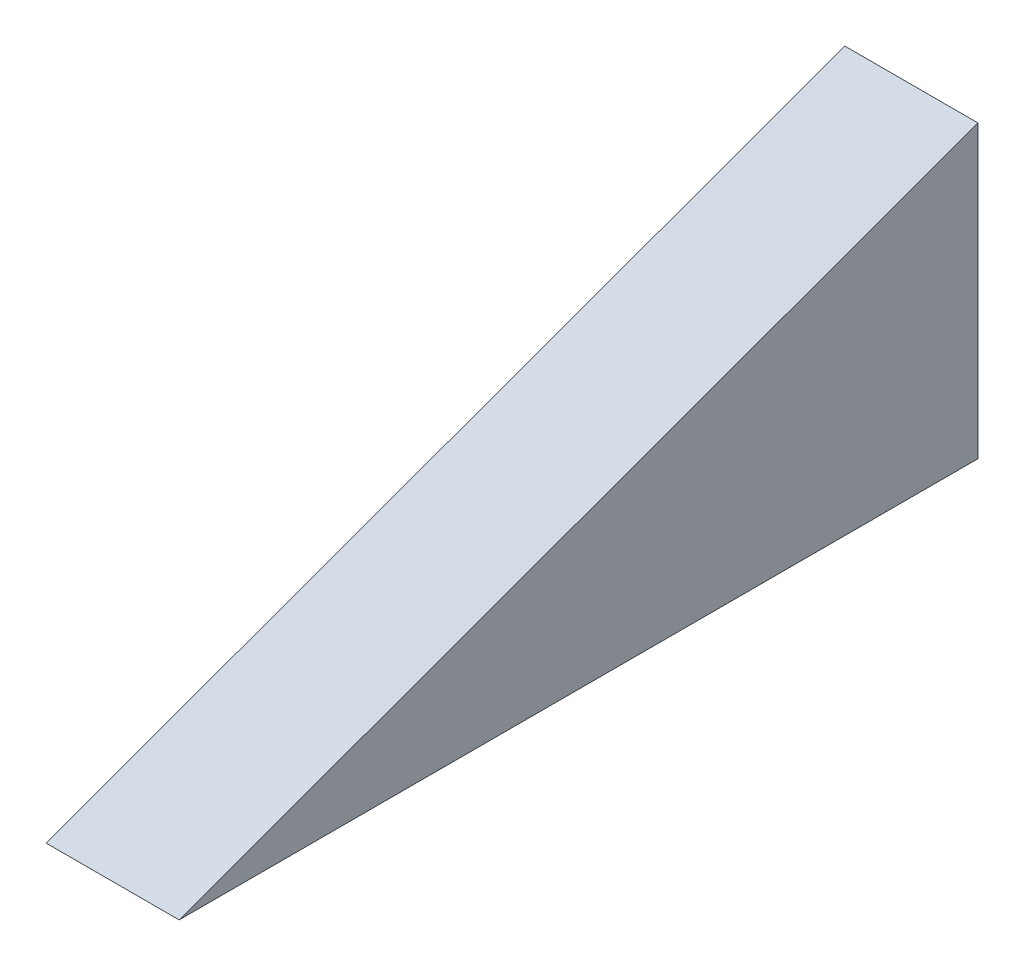
ISO-10303-21;
HEADER;
FILE_DESCRIPTION(('STEP AP214'),'2;1');
FILE_NAME('part.step','',(''),(''),'','','');
FILE_SCHEMA(('AUTOMOTIVE_DESIGN { 1 0 10303 214 1 1 1 1 }'));
ENDSEC;
DATA;
#1=APPLICATION_CONTEXT('core data for automotive mechanical design processes');
#2=APPLICATION_PROTOCOL_DEFINITION('international standard','automotive_design',2000,#1);
#3=PRODUCT_CONTEXT('',#1,'mechanical');
#4=PRODUCT('Part','Part','',(#3));
#5=PRODUCT_RELATED_PRODUCT_CATEGORY('part','',(#4));
#6=PRODUCT_DEFINITION_FORMATION('','',#4);
#7=PRODUCT_DEFINITION_CONTEXT('part definition',#1,'design');
#8=PRODUCT_DEFINITION('design','',#6,#7);
#9=PRODUCT_DEFINITION_SHAPE('','',#8);
#10=(LENGTH_UNIT() NAMED_UNIT(*) SI_UNIT(.MILLI.,.METRE.));
#11=(NAMED_UNIT(*) PLANE_ANGLE_UNIT() SI_UNIT($,.RADIAN.));
#12=(NAMED_UNIT(*) SI_UNIT($,.STERADIAN.) SOLID_ANGLE_UNIT());
#13=UNCERTAINTY_MEASURE_WITH_UNIT(LENGTH_MEASURE(1.E-05),#10,'distance_accuracy_value','');
#14=(GEOMETRIC_REPRESENTATION_CONTEXT(3) GLOBAL_UNCERTAINTY_ASSIGNED_CONTEXT((#13)) GLOBAL_UNIT_ASSIGNED_CONTEXT((#10,
#11,#12)) REPRESENTATION_CONTEXT('',''));
#15=CARTESIAN_POINT('',(0.,0.,0.));
#16=DIRECTION('',(0.,0.,1.));
#17=DIRECTION('',(1.,0.,0.));
#18=AXIS2_PLACEMENT_3D('',#15,#16,#17);
#19=CARTESIAN_POINT('',(25.4,55.4690637021682,-152.4));
#20=DIRECTION('',(0.,-0.93969262078591,-0.342020143325663));
#21=DIRECTION('',(0.,0.342020143325663,-0.939692620785911));
#22=AXIS2_PLACEMENT_3D('',#19,#20,#21);
#23=PLANE('',#22);
#24=DIRECTION('',(0.,-0.342020143325663,0.939692620785911));
#25=VECTOR('',#24,1.);
#26=CARTESIAN_POINT('',(0.,55.4690637021682,-152.4));
#27=LINE('',#26,#25);
#28=CARTESIAN_POINT('',(0.,55.4690637021682,-152.4));
#29=VERTEX_POINT('',#28);
#30=CARTESIAN_POINT('',(0.,0.,0.));
#31=VERTEX_POINT('',#30);
#32=EDGE_CURVE('E80',#29,#31,#27,.T.);
#33=ORIENTED_EDGE('',*,*,#32,.T.);
#34=DIRECTION('',(-1.,0.,0.));
#35=VECTOR('',#34,1.);
#36=CARTESIAN_POINT('',(25.4,0.,0.));
#37=LINE('',#36,#35);
#38=CARTESIAN_POINT('',(25.4,0.,0.));
#39=VERTEX_POINT('',#38);
#40=EDGE_CURVE('E11',#39,#31,#37,.T.);
#41=ORIENTED_EDGE('',*,*,#40,.F.);
#42=DIRECTION('',(0.,-0.342020143325663,0.939692620785911));
#43=VECTOR('',#42,1.);
#44=CARTESIAN_POINT('',(25.4,55.4690637021682,-152.4));
#45=LINE('',#44,#43);
#46=CARTESIAN_POINT('',(25.4,55.4690637021682,-152.4));
#47=VERTEX_POINT('',#46);
#48=EDGE_CURVE('E73',#47,#39,#45,.T.);
#49=ORIENTED_EDGE('',*,*,#48,.F.);
#50=DIRECTION('',(-1.,0.,0.));
#51=VECTOR('',#50,1.);
#52=CARTESIAN_POINT('',(25.4,55.4690637021682,-152.4));
#53=LINE('',#52,#51);
#54=EDGE_CURVE('E81',#47,#29,#53,.T.);
#55=ORIENTED_EDGE('',*,*,#54,.T.);
#56=EDGE_LOOP('',(#33,#41,#49,#55));
#57=FACE_BOUND('',#56,.T.);
#58=ADVANCED_FACE('F33',(#57),#23,.F.);
#59=CARTESIAN_POINT('',(25.4,0.,0.));
#60=DIRECTION('',(0.,1.,0.));
#61=DIRECTION('',(0.,0.,1.));
#62=AXIS2_PLACEMENT_3D('',#59,#60,#61);
#63=PLANE('',#62);
#64=DIRECTION('',(0.,0.,-1.));
#65=VECTOR('',#64,1.);
#66=CARTESIAN_POINT('',(0.,0.,0.));
#67=LINE('',#66,#65);
#68=CARTESIAN_POINT('',(0.,0.,-152.4));
#69=VERTEX_POINT('',#68);
#70=EDGE_CURVE('E61',#31,#69,#67,.T.);
#71=ORIENTED_EDGE('',*,*,#70,.T.);
#72=DIRECTION('',(-1.,0.,0.));
#73=VECTOR('',#72,1.);
#74=CARTESIAN_POINT('',(25.4,0.,-152.4));
#75=LINE('',#74,#73);
#76=CARTESIAN_POINT('',(25.4,0.,-152.4));
#77=VERTEX_POINT('',#76);
#78=EDGE_CURVE('E41',#77,#69,#75,.T.);
#79=ORIENTED_EDGE('',*,*,#78,.F.);
#80=DIRECTION('',(0.,0.,-1.));
#81=VECTOR('',#80,1.);
#82=CARTESIAN_POINT('',(25.4,0.,0.));
#83=LINE('',#82,#81);
#84=EDGE_CURVE('E69',#39,#77,#83,.T.);
#85=ORIENTED_EDGE('',*,*,#84,.F.);
#86=ORIENTED_EDGE('',*,*,#40,.T.);
#87=EDGE_LOOP('',(#71,#79,#85,#86));
#88=FACE_BOUND('',#87,.T.);
#89=ADVANCED_FACE('F70',(#88),#63,.F.);
#90=CARTESIAN_POINT('',(25.4,0.,-152.4));
#91=DIRECTION('',(0.,0.,1.));
#92=DIRECTION('',(1.,0.,0.));
#93=AXIS2_PLACEMENT_3D('',#90,#91,#92);
#94=PLANE('',#93);
#95=DIRECTION('',(0.,1.,0.));
#96=VECTOR('',#95,1.);
#97=CARTESIAN_POINT('',(0.,0.,-152.4));
#98=LINE('',#97,#96);
#99=EDGE_CURVE('E66',#69,#29,#98,.T.);
#100=ORIENTED_EDGE('',*,*,#99,.T.);
#101=ORIENTED_EDGE('',*,*,#54,.F.);
#102=DIRECTION('',(0.,1.,0.));
#103=VECTOR('',#102,1.);
#104=CARTESIAN_POINT('',(25.4,0.,-152.4));
#105=LINE('',#104,#103);
#106=EDGE_CURVE('E49',#77,#47,#105,.T.);
#107=ORIENTED_EDGE('',*,*,#106,.F.);
#108=ORIENTED_EDGE('',*,*,#78,.T.);
#109=EDGE_LOOP('',(#100,#101,#107,#108));
#110=FACE_BOUND('',#109,.T.);
#111=ADVANCED_FACE('F88',(#110),#94,.F.);
#112=CARTESIAN_POINT('',(25.4,0.,0.));
#113=DIRECTION('',(-1.,0.,0.));
#114=DIRECTION('',(0.,0.,1.));
#115=AXIS2_PLACEMENT_3D('',#112,#113,#114);
#116=PLANE('',#115);
#117=ORIENTED_EDGE('',*,*,#48,.T.);
#118=ORIENTED_EDGE('',*,*,#84,.T.);
#119=ORIENTED_EDGE('',*,*,#106,.T.);
#120=EDGE_LOOP('',(#117,#118,#119));
#121=FACE_BOUND('',#120,.T.);
#122=ADVANCED_FACE('F76',(#121),#116,.F.);
#123=CARTESIAN_POINT('',(0.,0.,0.));
#124=DIRECTION('',(-1.,0.,0.));
#125=DIRECTION('',(0.,0.,1.));
#126=AXIS2_PLACEMENT_3D('',#123,#124,#125);
#127=PLANE('',#126);
#128=ORIENTED_EDGE('',*,*,#32,.F.);
#129=ORIENTED_EDGE('',*,*,#99,.F.);
#130=ORIENTED_EDGE('',*,*,#70,.F.);
#131=EDGE_LOOP('',(#128,#129,#130));
#132=FACE_BOUND('',#131,.T.);
#133=ADVANCED_FACE('F89',(#132),#127,.T.);
#134=CLOSED_SHELL('',(#58,#89,#111,#122,#133));
#135=MANIFOLD_SOLID_BREP('B2',#134);
#136=ADVANCED_BREP_SHAPE_REPRESENTATION('',(#18,#135),#14);
#137=SHAPE_DEFINITION_REPRESENTATION(#9,#136);
ENDSEC;
END-ISO-10303-21;
